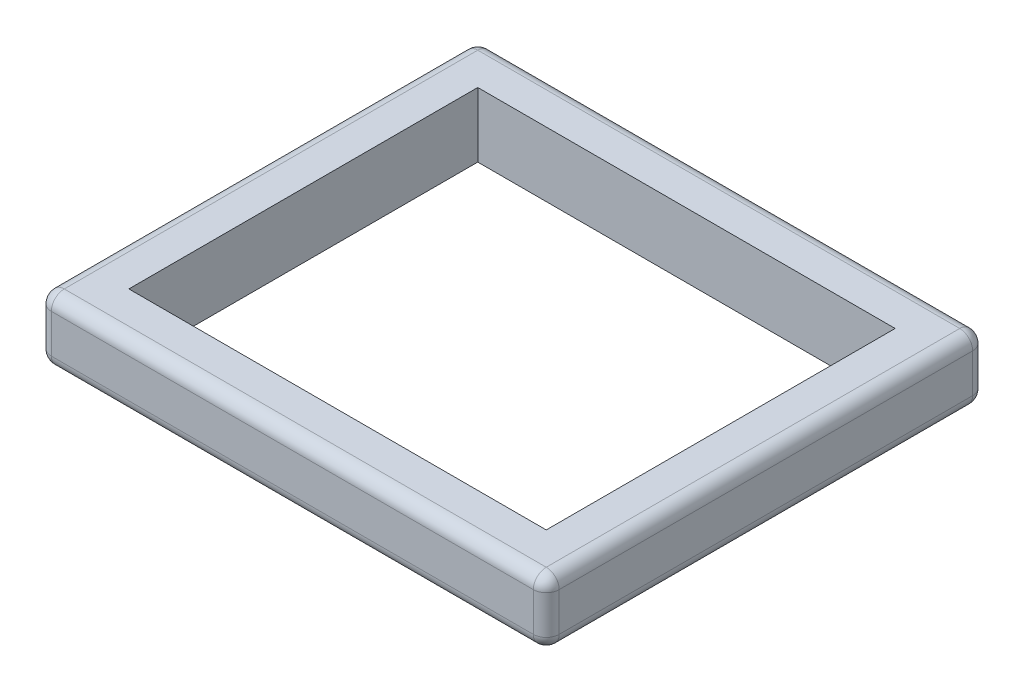
ISO-10303-21;
HEADER;
FILE_DESCRIPTION(('STEP AP214'),'2;1');
FILE_NAME('part.step','',(''),(''),'','','');
FILE_SCHEMA(('AUTOMOTIVE_DESIGN { 1 0 10303 214 1 1 1 1 }'));
ENDSEC;
DATA;
#1=APPLICATION_CONTEXT('core data for automotive mechanical design processes');
#2=APPLICATION_PROTOCOL_DEFINITION('international standard','automotive_design',2000,#1);
#3=PRODUCT_CONTEXT('',#1,'mechanical');
#4=PRODUCT('Part','Part','',(#3));
#5=PRODUCT_RELATED_PRODUCT_CATEGORY('part','',(#4));
#6=PRODUCT_DEFINITION_FORMATION('','',#4);
#7=PRODUCT_DEFINITION_CONTEXT('part definition',#1,'design');
#8=PRODUCT_DEFINITION('design','',#6,#7);
#9=PRODUCT_DEFINITION_SHAPE('','',#8);
#10=(LENGTH_UNIT() NAMED_UNIT(*) SI_UNIT(.MILLI.,.METRE.));
#11=(NAMED_UNIT(*) PLANE_ANGLE_UNIT() SI_UNIT($,.RADIAN.));
#12=(NAMED_UNIT(*) SI_UNIT($,.STERADIAN.) SOLID_ANGLE_UNIT());
#13=UNCERTAINTY_MEASURE_WITH_UNIT(LENGTH_MEASURE(1.E-05),#10,'distance_accuracy_value','');
#14=(GEOMETRIC_REPRESENTATION_CONTEXT(3) GLOBAL_UNCERTAINTY_ASSIGNED_CONTEXT((#13)) GLOBAL_UNIT_ASSIGNED_CONTEXT((#10,
#11,#12)) REPRESENTATION_CONTEXT('',''));
#15=CARTESIAN_POINT('',(0.,0.,0.));
#16=DIRECTION('',(0.,0.,1.));
#17=DIRECTION('',(1.,0.,0.));
#18=AXIS2_PLACEMENT_3D('',#15,#16,#17);
#19=CARTESIAN_POINT('',(725.233239936945,127.,413.743359462589));
#20=DIRECTION('',(0.,0.,1.));
#21=DIRECTION('',(1.,0.,0.));
#22=AXIS2_PLACEMENT_3D('',#19,#20,#21);
#23=PLANE('',#22);
#24=DIRECTION('',(0.,-1.,0.));
#25=VECTOR('',#24,1.);
#26=CARTESIAN_POINT('',(699.833239936945,127.,413.743359462589));
#27=LINE('',#26,#25);
#28=CARTESIAN_POINT('',(699.833239936945,25.4,413.743359462589));
#29=VERTEX_POINT('',#28);
#30=CARTESIAN_POINT('',(699.833239936945,101.6,413.743359462589));
#31=VERTEX_POINT('',#30);
#32=EDGE_CURVE('E206',#29,#31,#27,.F.);
#33=ORIENTED_EDGE('',*,*,#32,.T.);
#34=DIRECTION('',(-1.,0.,0.));
#35=VECTOR('',#34,1.);
#36=CARTESIAN_POINT('',(-272.986760063055,101.6,413.743359462589));
#37=LINE('',#36,#35);
#38=CARTESIAN_POINT('',(-247.586760063055,101.6,413.743359462589));
#39=VERTEX_POINT('',#38);
#40=EDGE_CURVE('E209',#31,#39,#37,.T.);
#41=ORIENTED_EDGE('',*,*,#40,.T.);
#42=DIRECTION('',(0.,-1.,0.));
#43=VECTOR('',#42,1.);
#44=CARTESIAN_POINT('',(-247.586760063055,127.,413.743359462589));
#45=LINE('',#44,#43);
#46=CARTESIAN_POINT('',(-247.586760063055,25.4,413.743359462589));
#47=VERTEX_POINT('',#46);
#48=EDGE_CURVE('E204',#39,#47,#45,.T.);
#49=ORIENTED_EDGE('',*,*,#48,.T.);
#50=DIRECTION('',(-1.,0.,0.));
#51=VECTOR('',#50,1.);
#52=CARTESIAN_POINT('',(725.233239936945,25.4,413.743359462589));
#53=LINE('',#52,#51);
#54=EDGE_CURVE('E202',#47,#29,#53,.F.);
#55=ORIENTED_EDGE('',*,*,#54,.T.);
#56=EDGE_LOOP('',(#33,#41,#49,#55));
#57=FACE_BOUND('',#56,.T.);
#58=ADVANCED_FACE('F38',(#57),#23,.T.);
#59=CARTESIAN_POINT('',(725.233239936945,127.,413.743359462589));
#60=DIRECTION('',(-1.,0.,0.));
#61=DIRECTION('',(0.,0.,1.));
#62=AXIS2_PLACEMENT_3D('',#59,#60,#61);
#63=PLANE('',#62);
#64=DIRECTION('',(0.,0.,-1.));
#65=VECTOR('',#64,1.);
#66=CARTESIAN_POINT('',(725.233239936945,101.6,413.743359462589));
#67=LINE('',#66,#65);
#68=CARTESIAN_POINT('',(725.233239936945,101.6,-424.456640537411));
#69=VERTEX_POINT('',#68);
#70=CARTESIAN_POINT('',(725.233239936945,101.6,388.343359462589));
#71=VERTEX_POINT('',#70);
#72=EDGE_CURVE('E197',#69,#71,#67,.F.);
#73=ORIENTED_EDGE('',*,*,#72,.T.);
#74=DIRECTION('',(0.,-1.,0.));
#75=VECTOR('',#74,1.);
#76=CARTESIAN_POINT('',(725.233239936945,0.,388.343359462589));
#77=LINE('',#76,#75);
#78=CARTESIAN_POINT('',(725.233239936945,25.4,388.343359462589));
#79=VERTEX_POINT('',#78);
#80=EDGE_CURVE('E199',#71,#79,#77,.T.);
#81=ORIENTED_EDGE('',*,*,#80,.T.);
#82=DIRECTION('',(0.,0.,-1.));
#83=VECTOR('',#82,1.);
#84=CARTESIAN_POINT('',(725.233239936945,25.4,-449.856640537411));
#85=LINE('',#84,#83);
#86=CARTESIAN_POINT('',(725.233239936945,25.4,-424.456640537411));
#87=VERTEX_POINT('',#86);
#88=EDGE_CURVE('E195',#79,#87,#85,.T.);
#89=ORIENTED_EDGE('',*,*,#88,.T.);
#90=DIRECTION('',(0.,-1.,0.));
#91=VECTOR('',#90,1.);
#92=CARTESIAN_POINT('',(725.233239936945,127.,-424.456640537411));
#93=LINE('',#92,#91);
#94=EDGE_CURVE('E190',#87,#69,#93,.F.);
#95=ORIENTED_EDGE('',*,*,#94,.T.);
#96=EDGE_LOOP('',(#73,#81,#89,#95));
#97=FACE_BOUND('',#96,.T.);
#98=ADVANCED_FACE('F340',(#97),#63,.F.);
#99=CARTESIAN_POINT('',(725.233239936945,127.,-449.856640537411));
#100=DIRECTION('',(0.,0.,1.));
#101=DIRECTION('',(1.,0.,0.));
#102=AXIS2_PLACEMENT_3D('',#99,#100,#101);
#103=PLANE('',#102);
#104=DIRECTION('',(0.,-1.,0.));
#105=VECTOR('',#104,1.);
#106=CARTESIAN_POINT('',(-247.586760063055,127.,-449.856640537411));
#107=LINE('',#106,#105);
#108=CARTESIAN_POINT('',(-247.586760063055,25.4,-449.856640537411));
#109=VERTEX_POINT('',#108);
#110=CARTESIAN_POINT('',(-247.586760063055,101.6,-449.856640537411));
#111=VERTEX_POINT('',#110);
#112=EDGE_CURVE('E47',#109,#111,#107,.F.);
#113=ORIENTED_EDGE('',*,*,#112,.T.);
#114=DIRECTION('',(-1.,0.,0.));
#115=VECTOR('',#114,1.);
#116=CARTESIAN_POINT('',(725.233239936945,101.6,-449.856640537411));
#117=LINE('',#116,#115);
#118=CARTESIAN_POINT('',(699.833239936945,101.6,-449.856640537411));
#119=VERTEX_POINT('',#118);
#120=EDGE_CURVE('E11',#111,#119,#117,.F.);
#121=ORIENTED_EDGE('',*,*,#120,.T.);
#122=DIRECTION('',(0.,-1.,0.));
#123=VECTOR('',#122,1.);
#124=CARTESIAN_POINT('',(699.833239936945,127.,-449.856640537411));
#125=LINE('',#124,#123);
#126=CARTESIAN_POINT('',(699.833239936945,25.4,-449.856640537411));
#127=VERTEX_POINT('',#126);
#128=EDGE_CURVE('E240',#119,#127,#125,.T.);
#129=ORIENTED_EDGE('',*,*,#128,.T.);
#130=DIRECTION('',(-1.,0.,0.));
#131=VECTOR('',#130,1.);
#132=CARTESIAN_POINT('',(-272.986760063055,25.4,-449.856640537411));
#133=LINE('',#132,#131);
#134=EDGE_CURVE('E238',#127,#109,#133,.T.);
#135=ORIENTED_EDGE('',*,*,#134,.T.);
#136=EDGE_LOOP('',(#113,#121,#129,#135));
#137=FACE_BOUND('',#136,.T.);
#138=ADVANCED_FACE('F346',(#137),#103,.F.);
#139=CARTESIAN_POINT('',(-272.986760063055,127.,413.743359462589));
#140=DIRECTION('',(-1.,0.,0.));
#141=DIRECTION('',(0.,0.,1.));
#142=AXIS2_PLACEMENT_3D('',#139,#140,#141);
#143=PLANE('',#142);
#144=DIRECTION('',(0.,0.,-1.));
#145=VECTOR('',#144,1.);
#146=CARTESIAN_POINT('',(-272.986760063055,25.4,413.743359462589));
#147=LINE('',#146,#145);
#148=CARTESIAN_POINT('',(-272.986760063055,25.4,-424.456640537411));
#149=VERTEX_POINT('',#148);
#150=CARTESIAN_POINT('',(-272.986760063055,25.4,388.343359462589));
#151=VERTEX_POINT('',#150);
#152=EDGE_CURVE('E215',#149,#151,#147,.F.);
#153=ORIENTED_EDGE('',*,*,#152,.T.);
#154=DIRECTION('',(0.,-1.,0.));
#155=VECTOR('',#154,1.);
#156=CARTESIAN_POINT('',(-272.986760063055,127.,388.343359462589));
#157=LINE('',#156,#155);
#158=CARTESIAN_POINT('',(-272.986760063055,101.6,388.343359462589));
#159=VERTEX_POINT('',#158);
#160=EDGE_CURVE('E217',#151,#159,#157,.F.);
#161=ORIENTED_EDGE('',*,*,#160,.T.);
#162=DIRECTION('',(0.,0.,-1.));
#163=VECTOR('',#162,1.);
#164=CARTESIAN_POINT('',(-272.986760063055,101.6,-449.856640537411));
#165=LINE('',#164,#163);
#166=CARTESIAN_POINT('',(-272.986760063055,101.6,-424.456640537411));
#167=VERTEX_POINT('',#166);
#168=EDGE_CURVE('E213',#159,#167,#165,.T.);
#169=ORIENTED_EDGE('',*,*,#168,.T.);
#170=DIRECTION('',(0.,-1.,0.));
#171=VECTOR('',#170,1.);
#172=CARTESIAN_POINT('',(-272.986760063055,0.,-424.456640537411));
#173=LINE('',#172,#171);
#174=EDGE_CURVE('E211',#167,#149,#173,.T.);
#175=ORIENTED_EDGE('',*,*,#174,.T.);
#176=EDGE_LOOP('',(#153,#161,#169,#175));
#177=FACE_BOUND('',#176,.T.);
#178=ADVANCED_FACE('F351',(#177),#143,.T.);
#179=CARTESIAN_POINT('',(0.,127.,0.));
#180=DIRECTION('',(0.,-1.,0.));
#181=DIRECTION('',(0.,0.,-1.));
#182=AXIS2_PLACEMENT_3D('',#179,#180,#181);
#183=PLANE('',#182);
#184=DIRECTION('',(-1.,0.,0.));
#185=VECTOR('',#184,1.);
#186=CARTESIAN_POINT('',(0.,127.,-424.456640537411));
#187=LINE('',#186,#185);
#188=CARTESIAN_POINT('',(699.833239936945,127.,-424.456640537411));
#189=VERTEX_POINT('',#188);
#190=CARTESIAN_POINT('',(-247.586760063055,127.,-424.456640537411));
#191=VERTEX_POINT('',#190);
#192=EDGE_CURVE('E229',#189,#191,#187,.T.);
#193=ORIENTED_EDGE('',*,*,#192,.T.);
#194=DIRECTION('',(0.,0.,-1.));
#195=VECTOR('',#194,1.);
#196=CARTESIAN_POINT('',(-247.586760063055,127.,413.743359462589));
#197=LINE('',#196,#195);
#198=CARTESIAN_POINT('',(-247.586760063055,127.,388.343359462589));
#199=VERTEX_POINT('',#198);
#200=EDGE_CURVE('E235',#191,#199,#197,.F.);
#201=ORIENTED_EDGE('',*,*,#200,.T.);
#202=DIRECTION('',(-1.,0.,0.));
#203=VECTOR('',#202,1.);
#204=CARTESIAN_POINT('',(725.233239936945,127.,388.343359462589));
#205=LINE('',#204,#203);
#206=CARTESIAN_POINT('',(699.833239936945,127.,388.343359462589));
#207=VERTEX_POINT('',#206);
#208=EDGE_CURVE('E233',#199,#207,#205,.F.);
#209=ORIENTED_EDGE('',*,*,#208,.T.);
#210=DIRECTION('',(0.,0.,-1.));
#211=VECTOR('',#210,1.);
#212=CARTESIAN_POINT('',(699.833239936945,127.,0.));
#213=LINE('',#212,#211);
#214=EDGE_CURVE('E231',#207,#189,#213,.T.);
#215=ORIENTED_EDGE('',*,*,#214,.T.);
#216=EDGE_LOOP('',(#193,#201,#209,#215));
#217=FACE_BOUND('',#216,.T.);
#218=DIRECTION('',(-1.,0.,0.));
#219=VECTOR('',#218,1.);
#220=CARTESIAN_POINT('',(636.333239936945,127.,324.843359462589));
#221=LINE('',#220,#219);
#222=CARTESIAN_POINT('',(636.333239936945,127.,324.843359462589));
#223=VERTEX_POINT('',#222);
#224=CARTESIAN_POINT('',(-184.086760063055,127.,324.843359462589));
#225=VERTEX_POINT('',#224);
#226=EDGE_CURVE('E163',#223,#225,#221,.T.);
#227=ORIENTED_EDGE('',*,*,#226,.T.);
#228=DIRECTION('',(0.,0.,-1.));
#229=VECTOR('',#228,1.);
#230=CARTESIAN_POINT('',(-184.086760063055,127.,-360.956640537411));
#231=LINE('',#230,#229);
#232=CARTESIAN_POINT('',(-184.086760063055,127.,-360.956640537411));
#233=VERTEX_POINT('',#232);
#234=EDGE_CURVE('E155',#225,#233,#231,.T.);
#235=ORIENTED_EDGE('',*,*,#234,.T.);
#236=DIRECTION('',(1.,0.,0.));
#237=VECTOR('',#236,1.);
#238=CARTESIAN_POINT('',(636.333239936945,127.,-360.956640537411));
#239=LINE('',#238,#237);
#240=CARTESIAN_POINT('',(636.333239936945,127.,-360.956640537411));
#241=VERTEX_POINT('',#240);
#242=EDGE_CURVE('E167',#233,#241,#239,.T.);
#243=ORIENTED_EDGE('',*,*,#242,.T.);
#244=DIRECTION('',(0.,0.,1.));
#245=VECTOR('',#244,1.);
#246=CARTESIAN_POINT('',(636.333239936945,127.,-360.956640537411));
#247=LINE('',#246,#245);
#248=EDGE_CURVE('E171',#241,#223,#247,.T.);
#249=ORIENTED_EDGE('',*,*,#248,.T.);
#250=EDGE_LOOP('',(#227,#235,#243,#249));
#251=FACE_BOUND('',#250,.T.);
#252=ADVANCED_FACE('F173',(#217,#251),#183,.F.);
#253=CARTESIAN_POINT('',(0.,0.,0.));
#254=DIRECTION('',(0.,-1.,0.));
#255=DIRECTION('',(0.,0.,-1.));
#256=AXIS2_PLACEMENT_3D('',#253,#254,#255);
#257=PLANE('',#256);
#258=DIRECTION('',(-1.,0.,0.));
#259=VECTOR('',#258,1.);
#260=CARTESIAN_POINT('',(0.,0.,388.343359462589));
#261=LINE('',#260,#259);
#262=CARTESIAN_POINT('',(699.833239936945,0.,388.343359462589));
#263=VERTEX_POINT('',#262);
#264=CARTESIAN_POINT('',(-247.586760063055,0.,388.343359462589));
#265=VERTEX_POINT('',#264);
#266=EDGE_CURVE('E224',#263,#265,#261,.T.);
#267=ORIENTED_EDGE('',*,*,#266,.T.);
#268=DIRECTION('',(0.,0.,-1.));
#269=VECTOR('',#268,1.);
#270=CARTESIAN_POINT('',(-247.586760063055,0.,0.));
#271=LINE('',#270,#269);
#272=CARTESIAN_POINT('',(-247.586760063055,0.,-424.456640537411));
#273=VERTEX_POINT('',#272);
#274=EDGE_CURVE('E226',#265,#273,#271,.T.);
#275=ORIENTED_EDGE('',*,*,#274,.T.);
#276=DIRECTION('',(-1.,0.,0.));
#277=VECTOR('',#276,1.);
#278=CARTESIAN_POINT('',(725.233239936945,0.,-424.456640537411));
#279=LINE('',#278,#277);
#280=CARTESIAN_POINT('',(699.833239936945,0.,-424.456640537411));
#281=VERTEX_POINT('',#280);
#282=EDGE_CURVE('E220',#273,#281,#279,.F.);
#283=ORIENTED_EDGE('',*,*,#282,.T.);
#284=DIRECTION('',(0.,0.,-1.));
#285=VECTOR('',#284,1.);
#286=CARTESIAN_POINT('',(699.833239936945,0.,413.743359462589));
#287=LINE('',#286,#285);
#288=EDGE_CURVE('E222',#281,#263,#287,.F.);
#289=ORIENTED_EDGE('',*,*,#288,.T.);
#290=EDGE_LOOP('',(#267,#275,#283,#289));
#291=FACE_BOUND('',#290,.T.);
#292=DIRECTION('',(0.,0.,-1.));
#293=VECTOR('',#292,1.);
#294=CARTESIAN_POINT('',(-184.086760063055,0.,-360.956640537411));
#295=LINE('',#294,#293);
#296=CARTESIAN_POINT('',(-184.086760063055,0.,324.843359462589));
#297=VERTEX_POINT('',#296);
#298=CARTESIAN_POINT('',(-184.086760063055,0.,-360.956640537411));
#299=VERTEX_POINT('',#298);
#300=EDGE_CURVE('E158',#297,#299,#295,.T.);
#301=ORIENTED_EDGE('',*,*,#300,.F.);
#302=DIRECTION('',(-1.,0.,0.));
#303=VECTOR('',#302,1.);
#304=CARTESIAN_POINT('',(636.333239936945,0.,324.843359462589));
#305=LINE('',#304,#303);
#306=CARTESIAN_POINT('',(636.333239936945,0.,324.843359462589));
#307=VERTEX_POINT('',#306);
#308=EDGE_CURVE('E175',#307,#297,#305,.T.);
#309=ORIENTED_EDGE('',*,*,#308,.F.);
#310=DIRECTION('',(0.,0.,1.));
#311=VECTOR('',#310,1.);
#312=CARTESIAN_POINT('',(636.333239936945,0.,-360.956640537411));
#313=LINE('',#312,#311);
#314=CARTESIAN_POINT('',(636.333239936945,0.,-360.956640537411));
#315=VERTEX_POINT('',#314);
#316=EDGE_CURVE('E178',#315,#307,#313,.T.);
#317=ORIENTED_EDGE('',*,*,#316,.F.);
#318=DIRECTION('',(1.,0.,0.));
#319=VECTOR('',#318,1.);
#320=CARTESIAN_POINT('',(636.333239936945,0.,-360.956640537411));
#321=LINE('',#320,#319);
#322=EDGE_CURVE('E184',#299,#315,#321,.T.);
#323=ORIENTED_EDGE('',*,*,#322,.F.);
#324=EDGE_LOOP('',(#301,#309,#317,#323));
#325=FACE_BOUND('',#324,.T.);
#326=ADVANCED_FACE('F416',(#291,#325),#257,.T.);
#327=CARTESIAN_POINT('',(-184.086760063055,127.,-360.956640537411));
#328=DIRECTION('',(-1.,0.,0.));
#329=DIRECTION('',(0.,0.,1.));
#330=AXIS2_PLACEMENT_3D('',#327,#328,#329);
#331=PLANE('',#330);
#332=ORIENTED_EDGE('',*,*,#300,.T.);
#333=DIRECTION('',(0.,-1.,0.));
#334=VECTOR('',#333,1.);
#335=CARTESIAN_POINT('',(-184.086760063055,127.,-360.956640537411));
#336=LINE('',#335,#334);
#337=EDGE_CURVE('E151',#233,#299,#336,.T.);
#338=ORIENTED_EDGE('',*,*,#337,.F.);
#339=ORIENTED_EDGE('',*,*,#234,.F.);
#340=DIRECTION('',(0.,-1.,0.));
#341=VECTOR('',#340,1.);
#342=CARTESIAN_POINT('',(-184.086760063055,127.,324.843359462589));
#343=LINE('',#342,#341);
#344=EDGE_CURVE('E188',#225,#297,#343,.T.);
#345=ORIENTED_EDGE('',*,*,#344,.T.);
#346=EDGE_LOOP('',(#332,#338,#339,#345));
#347=FACE_BOUND('',#346,.T.);
#348=ADVANCED_FACE('F153',(#347),#331,.F.);
#349=CARTESIAN_POINT('',(636.333239936945,127.,324.843359462589));
#350=DIRECTION('',(0.,0.,1.));
#351=DIRECTION('',(1.,0.,0.));
#352=AXIS2_PLACEMENT_3D('',#349,#350,#351);
#353=PLANE('',#352);
#354=ORIENTED_EDGE('',*,*,#308,.T.);
#355=ORIENTED_EDGE('',*,*,#344,.F.);
#356=ORIENTED_EDGE('',*,*,#226,.F.);
#357=DIRECTION('',(0.,-1.,0.));
#358=VECTOR('',#357,1.);
#359=CARTESIAN_POINT('',(636.333239936945,127.,324.843359462589));
#360=LINE('',#359,#358);
#361=EDGE_CURVE('E191',#223,#307,#360,.T.);
#362=ORIENTED_EDGE('',*,*,#361,.T.);
#363=EDGE_LOOP('',(#354,#355,#356,#362));
#364=FACE_BOUND('',#363,.T.);
#365=ADVANCED_FACE('F454',(#364),#353,.F.);
#366=CARTESIAN_POINT('',(636.333239936945,127.,-360.956640537411));
#367=DIRECTION('',(1.,0.,0.));
#368=DIRECTION('',(0.,0.,-1.));
#369=AXIS2_PLACEMENT_3D('',#366,#367,#368);
#370=PLANE('',#369);
#371=ORIENTED_EDGE('',*,*,#316,.T.);
#372=ORIENTED_EDGE('',*,*,#361,.F.);
#373=ORIENTED_EDGE('',*,*,#248,.F.);
#374=DIRECTION('',(0.,-1.,0.));
#375=VECTOR('',#374,1.);
#376=CARTESIAN_POINT('',(636.333239936945,127.,-360.956640537411));
#377=LINE('',#376,#375);
#378=EDGE_CURVE('E162',#241,#315,#377,.T.);
#379=ORIENTED_EDGE('',*,*,#378,.T.);
#380=EDGE_LOOP('',(#371,#372,#373,#379));
#381=FACE_BOUND('',#380,.T.);
#382=ADVANCED_FACE('F457',(#381),#370,.F.);
#383=CARTESIAN_POINT('',(636.333239936945,127.,-360.956640537411));
#384=DIRECTION('',(0.,0.,-1.));
#385=DIRECTION('',(-1.,0.,0.));
#386=AXIS2_PLACEMENT_3D('',#383,#384,#385);
#387=PLANE('',#386);
#388=ORIENTED_EDGE('',*,*,#322,.T.);
#389=ORIENTED_EDGE('',*,*,#378,.F.);
#390=ORIENTED_EDGE('',*,*,#242,.F.);
#391=ORIENTED_EDGE('',*,*,#337,.T.);
#392=EDGE_LOOP('',(#388,#389,#390,#391));
#393=FACE_BOUND('',#392,.T.);
#394=ADVANCED_FACE('F168',(#393),#387,.F.);
#395=CARTESIAN_POINT('',(-247.586760063055,127.,-424.456640537411));
#396=DIRECTION('',(0.,1.,0.));
#397=DIRECTION('',(0.,0.,1.));
#398=AXIS2_PLACEMENT_3D('',#395,#396,#397);
#399=CYLINDRICAL_SURFACE('',#398,25.4);
#400=CARTESIAN_POINT('',(-247.586760063055,101.6,-424.456640537411));
#401=DIRECTION('',(0.,1.,0.));
#402=DIRECTION('',(0.,0.,1.));
#403=AXIS2_PLACEMENT_3D('',#400,#401,#402);
#404=CIRCLE('',#403,25.4);
#405=EDGE_CURVE('E42',#111,#167,#404,.T.);
#406=ORIENTED_EDGE('',*,*,#405,.F.);
#407=ORIENTED_EDGE('',*,*,#112,.F.);
#408=CARTESIAN_POINT('',(-247.586760063055,25.4,-424.456640537411));
#409=DIRECTION('',(0.,-1.,0.));
#410=DIRECTION('',(0.,0.,-1.));
#411=AXIS2_PLACEMENT_3D('',#408,#409,#410);
#412=CIRCLE('',#411,25.4);
#413=EDGE_CURVE('E304',#149,#109,#412,.T.);
#414=ORIENTED_EDGE('',*,*,#413,.F.);
#415=ORIENTED_EDGE('',*,*,#174,.F.);
#416=EDGE_LOOP('',(#406,#407,#414,#415));
#417=FACE_BOUND('',#416,.T.);
#418=ADVANCED_FACE('F40',(#417),#399,.T.);
#419=CARTESIAN_POINT('',(-247.586760063055,101.6,-424.456640537411));
#420=DIRECTION('',(0.,0.,1.));
#421=DIRECTION('',(1.,0.,0.));
#422=AXIS2_PLACEMENT_3D('',#419,#420,#421);
#423=SPHERICAL_SURFACE('',#422,25.4);
#424=CARTESIAN_POINT('',(-247.586760063055,101.6,-424.456640537411));
#425=DIRECTION('',(-1.,0.,0.));
#426=DIRECTION('',(0.,0.,1.));
#427=AXIS2_PLACEMENT_3D('',#424,#425,#426);
#428=CIRCLE('',#427,25.4);
#429=EDGE_CURVE('E300',#111,#191,#428,.F.);
#430=ORIENTED_EDGE('',*,*,#429,.F.);
#431=ORIENTED_EDGE('',*,*,#405,.T.);
#432=CARTESIAN_POINT('',(-247.586760063055,101.6,-424.456640537411));
#433=DIRECTION('',(0.,0.,-1.));
#434=DIRECTION('',(-1.,0.,0.));
#435=AXIS2_PLACEMENT_3D('',#432,#433,#434);
#436=CIRCLE('',#435,25.4);
#437=EDGE_CURVE('E302',#191,#167,#436,.F.);
#438=ORIENTED_EDGE('',*,*,#437,.F.);
#439=EDGE_LOOP('',(#430,#431,#438));
#440=FACE_BOUND('',#439,.T.);
#441=ADVANCED_FACE('F314',(#440),#423,.T.);
#442=CARTESIAN_POINT('',(-247.586760063055,25.4,-424.456640537411));
#443=DIRECTION('',(0.,0.,1.));
#444=DIRECTION('',(1.,0.,0.));
#445=AXIS2_PLACEMENT_3D('',#442,#443,#444);
#446=SPHERICAL_SURFACE('',#445,25.4);
#447=CARTESIAN_POINT('',(-247.586760063055,25.4,-424.456640537411));
#448=DIRECTION('',(0.,0.,-1.));
#449=DIRECTION('',(-1.,0.,0.));
#450=AXIS2_PLACEMENT_3D('',#447,#448,#449);
#451=CIRCLE('',#450,25.4);
#452=EDGE_CURVE('E294',#149,#273,#451,.F.);
#453=ORIENTED_EDGE('',*,*,#452,.F.);
#454=ORIENTED_EDGE('',*,*,#413,.T.);
#455=CARTESIAN_POINT('',(-247.586760063055,25.4,-424.456640537411));
#456=DIRECTION('',(-1.,0.,0.));
#457=DIRECTION('',(0.,0.,1.));
#458=AXIS2_PLACEMENT_3D('',#455,#456,#457);
#459=CIRCLE('',#458,25.4);
#460=EDGE_CURVE('E297',#273,#109,#459,.F.);
#461=ORIENTED_EDGE('',*,*,#460,.F.);
#462=EDGE_LOOP('',(#453,#454,#461));
#463=FACE_BOUND('',#462,.T.);
#464=ADVANCED_FACE('F337',(#463),#446,.T.);
#465=CARTESIAN_POINT('',(-247.586760063055,101.6,413.743359462589));
#466=DIRECTION('',(0.,0.,1.));
#467=DIRECTION('',(1.,0.,0.));
#468=AXIS2_PLACEMENT_3D('',#465,#466,#467);
#469=CYLINDRICAL_SURFACE('',#468,25.4);
#470=ORIENTED_EDGE('',*,*,#437,.T.);
#471=ORIENTED_EDGE('',*,*,#168,.F.);
#472=CARTESIAN_POINT('',(-247.586760063055,101.6,388.343359462589));
#473=DIRECTION('',(0.,0.,1.));
#474=DIRECTION('',(1.,0.,0.));
#475=AXIS2_PLACEMENT_3D('',#472,#473,#474);
#476=CIRCLE('',#475,25.4);
#477=EDGE_CURVE('E289',#199,#159,#476,.T.);
#478=ORIENTED_EDGE('',*,*,#477,.F.);
#479=ORIENTED_EDGE('',*,*,#200,.F.);
#480=EDGE_LOOP('',(#470,#471,#478,#479));
#481=FACE_BOUND('',#480,.T.);
#482=ADVANCED_FACE('F321',(#481),#469,.T.);
#483=CARTESIAN_POINT('',(0.,101.6,-424.456640537411));
#484=DIRECTION('',(-1.,0.,0.));
#485=DIRECTION('',(0.,0.,1.));
#486=AXIS2_PLACEMENT_3D('',#483,#484,#485);
#487=CYLINDRICAL_SURFACE('',#486,25.4);
#488=ORIENTED_EDGE('',*,*,#429,.T.);
#489=ORIENTED_EDGE('',*,*,#192,.F.);
#490=CARTESIAN_POINT('',(699.833239936945,101.6,-424.456640537411));
#491=DIRECTION('',(1.,0.,0.));
#492=DIRECTION('',(0.,0.,-1.));
#493=AXIS2_PLACEMENT_3D('',#490,#491,#492);
#494=CIRCLE('',#493,25.4);
#495=EDGE_CURVE('E286',#119,#189,#494,.T.);
#496=ORIENTED_EDGE('',*,*,#495,.F.);
#497=ORIENTED_EDGE('',*,*,#120,.F.);
#498=EDGE_LOOP('',(#488,#489,#496,#497));
#499=FACE_BOUND('',#498,.T.);
#500=ADVANCED_FACE('F326',(#499),#487,.T.);
#501=CARTESIAN_POINT('',(699.833239936945,127.,-424.456640537411));
#502=DIRECTION('',(0.,-1.,0.));
#503=DIRECTION('',(0.,0.,-1.));
#504=AXIS2_PLACEMENT_3D('',#501,#502,#503);
#505=CYLINDRICAL_SURFACE('',#504,25.4);
#506=CARTESIAN_POINT('',(699.833239936945,25.4,-424.456640537411));
#507=DIRECTION('',(0.,-1.,0.));
#508=DIRECTION('',(0.,0.,-1.));
#509=AXIS2_PLACEMENT_3D('',#506,#507,#508);
#510=CIRCLE('',#509,25.4);
#511=EDGE_CURVE('E280',#127,#87,#510,.T.);
#512=ORIENTED_EDGE('',*,*,#511,.F.);
#513=ORIENTED_EDGE('',*,*,#128,.F.);
#514=CARTESIAN_POINT('',(699.833239936945,101.6,-424.456640537411));
#515=DIRECTION('',(0.,1.,0.));
#516=DIRECTION('',(0.,0.,1.));
#517=AXIS2_PLACEMENT_3D('',#514,#515,#516);
#518=CIRCLE('',#517,25.4);
#519=EDGE_CURVE('E283',#69,#119,#518,.T.);
#520=ORIENTED_EDGE('',*,*,#519,.F.);
#521=ORIENTED_EDGE('',*,*,#94,.F.);
#522=EDGE_LOOP('',(#512,#513,#520,#521));
#523=FACE_BOUND('',#522,.T.);
#524=ADVANCED_FACE('F328',(#523),#505,.T.);
#525=CARTESIAN_POINT('',(725.233239936945,25.4,-424.456640537411));
#526=DIRECTION('',(1.,0.,0.));
#527=DIRECTION('',(0.,0.,-1.));
#528=AXIS2_PLACEMENT_3D('',#525,#526,#527);
#529=CYLINDRICAL_SURFACE('',#528,25.4);
#530=ORIENTED_EDGE('',*,*,#460,.T.);
#531=ORIENTED_EDGE('',*,*,#134,.F.);
#532=CARTESIAN_POINT('',(699.833239936945,25.4,-424.456640537411));
#533=DIRECTION('',(1.,0.,0.));
#534=DIRECTION('',(0.,0.,-1.));
#535=AXIS2_PLACEMENT_3D('',#532,#533,#534);
#536=CIRCLE('',#535,25.4);
#537=EDGE_CURVE('E277',#281,#127,#536,.T.);
#538=ORIENTED_EDGE('',*,*,#537,.F.);
#539=ORIENTED_EDGE('',*,*,#282,.F.);
#540=EDGE_LOOP('',(#530,#531,#538,#539));
#541=FACE_BOUND('',#540,.T.);
#542=ADVANCED_FACE('F334',(#541),#529,.T.);
#543=CARTESIAN_POINT('',(-247.586760063055,25.4,0.));
#544=DIRECTION('',(0.,0.,-1.));
#545=DIRECTION('',(-1.,0.,0.));
#546=AXIS2_PLACEMENT_3D('',#543,#544,#545);
#547=CYLINDRICAL_SURFACE('',#546,25.4);
#548=ORIENTED_EDGE('',*,*,#452,.T.);
#549=ORIENTED_EDGE('',*,*,#274,.F.);
#550=CARTESIAN_POINT('',(-247.586760063055,25.4,388.343359462589));
#551=DIRECTION('',(0.,0.,1.));
#552=DIRECTION('',(1.,0.,0.));
#553=AXIS2_PLACEMENT_3D('',#550,#551,#552);
#554=CIRCLE('',#553,25.4);
#555=EDGE_CURVE('E274',#151,#265,#554,.T.);
#556=ORIENTED_EDGE('',*,*,#555,.F.);
#557=ORIENTED_EDGE('',*,*,#152,.F.);
#558=EDGE_LOOP('',(#548,#549,#556,#557));
#559=FACE_BOUND('',#558,.T.);
#560=ADVANCED_FACE('F400',(#559),#547,.T.);
#561=CARTESIAN_POINT('',(-247.586760063055,127.,388.343359462589));
#562=DIRECTION('',(0.,-1.,0.));
#563=DIRECTION('',(0.,0.,-1.));
#564=AXIS2_PLACEMENT_3D('',#561,#562,#563);
#565=CYLINDRICAL_SURFACE('',#564,25.4);
#566=CARTESIAN_POINT('',(-247.586760063055,101.6,388.343359462589));
#567=DIRECTION('',(0.,1.,0.));
#568=DIRECTION('',(0.,0.,1.));
#569=AXIS2_PLACEMENT_3D('',#566,#567,#568);
#570=CIRCLE('',#569,25.4);
#571=EDGE_CURVE('E291',#159,#39,#570,.T.);
#572=ORIENTED_EDGE('',*,*,#571,.F.);
#573=ORIENTED_EDGE('',*,*,#160,.F.);
#574=CARTESIAN_POINT('',(-247.586760063055,25.4,388.343359462589));
#575=DIRECTION('',(0.,-1.,0.));
#576=DIRECTION('',(0.,0.,-1.));
#577=AXIS2_PLACEMENT_3D('',#574,#575,#576);
#578=CIRCLE('',#577,25.4);
#579=EDGE_CURVE('E271',#47,#151,#578,.T.);
#580=ORIENTED_EDGE('',*,*,#579,.F.);
#581=ORIENTED_EDGE('',*,*,#48,.F.);
#582=EDGE_LOOP('',(#572,#573,#580,#581));
#583=FACE_BOUND('',#582,.T.);
#584=ADVANCED_FACE('F396',(#583),#565,.T.);
#585=CARTESIAN_POINT('',(-247.586760063055,101.6,388.343359462589));
#586=DIRECTION('',(0.,0.,1.));
#587=DIRECTION('',(1.,0.,0.));
#588=AXIS2_PLACEMENT_3D('',#585,#586,#587);
#589=SPHERICAL_SURFACE('',#588,25.4);
#590=ORIENTED_EDGE('',*,*,#477,.T.);
#591=ORIENTED_EDGE('',*,*,#571,.T.);
#592=CARTESIAN_POINT('',(-247.586760063055,101.6,388.343359462589));
#593=DIRECTION('',(-1.,0.,0.));
#594=DIRECTION('',(0.,-1.,0.));
#595=AXIS2_PLACEMENT_3D('',#592,#593,#594);
#596=CIRCLE('',#595,25.4);
#597=EDGE_CURVE('E268',#199,#39,#596,.F.);
#598=ORIENTED_EDGE('',*,*,#597,.F.);
#599=EDGE_LOOP('',(#590,#591,#598));
#600=FACE_BOUND('',#599,.T.);
#601=ADVANCED_FACE('F392',(#600),#589,.T.);
#602=CARTESIAN_POINT('',(699.833239936945,101.6,-424.456640537411));
#603=DIRECTION('',(0.,0.,1.));
#604=DIRECTION('',(1.,0.,0.));
#605=AXIS2_PLACEMENT_3D('',#602,#603,#604);
#606=SPHERICAL_SURFACE('',#605,25.4);
#607=ORIENTED_EDGE('',*,*,#519,.T.);
#608=ORIENTED_EDGE('',*,*,#495,.T.);
#609=CARTESIAN_POINT('',(699.833239936945,101.6,-424.456640537411));
#610=DIRECTION('',(0.,0.,-1.));
#611=DIRECTION('',(-1.,0.,0.));
#612=AXIS2_PLACEMENT_3D('',#609,#610,#611);
#613=CIRCLE('',#612,25.4);
#614=EDGE_CURVE('E265',#69,#189,#613,.F.);
#615=ORIENTED_EDGE('',*,*,#614,.F.);
#616=EDGE_LOOP('',(#607,#608,#615));
#617=FACE_BOUND('',#616,.T.);
#618=ADVANCED_FACE('F388',(#617),#606,.T.);
#619=CARTESIAN_POINT('',(699.833239936945,25.4,-424.456640537411));
#620=DIRECTION('',(0.,0.,1.));
#621=DIRECTION('',(1.,0.,0.));
#622=AXIS2_PLACEMENT_3D('',#619,#620,#621);
#623=SPHERICAL_SURFACE('',#622,25.4);
#624=ORIENTED_EDGE('',*,*,#537,.T.);
#625=ORIENTED_EDGE('',*,*,#511,.T.);
#626=CARTESIAN_POINT('',(699.833239936945,25.4,-424.456640537411));
#627=DIRECTION('',(0.,0.,-1.));
#628=DIRECTION('',(-1.,0.,0.));
#629=AXIS2_PLACEMENT_3D('',#626,#627,#628);
#630=CIRCLE('',#629,25.4);
#631=EDGE_CURVE('E262',#281,#87,#630,.F.);
#632=ORIENTED_EDGE('',*,*,#631,.F.);
#633=EDGE_LOOP('',(#624,#625,#632));
#634=FACE_BOUND('',#633,.T.);
#635=ADVANCED_FACE('F384',(#634),#623,.T.);
#636=CARTESIAN_POINT('',(-247.586760063055,25.4,388.343359462589));
#637=DIRECTION('',(0.,0.,1.));
#638=DIRECTION('',(1.,0.,0.));
#639=AXIS2_PLACEMENT_3D('',#636,#637,#638);
#640=SPHERICAL_SURFACE('',#639,25.4);
#641=ORIENTED_EDGE('',*,*,#579,.T.);
#642=ORIENTED_EDGE('',*,*,#555,.T.);
#643=CARTESIAN_POINT('',(-247.586760063055,25.4,388.343359462589));
#644=DIRECTION('',(-1.,0.,0.));
#645=DIRECTION('',(0.,0.,1.));
#646=AXIS2_PLACEMENT_3D('',#643,#644,#645);
#647=CIRCLE('',#646,25.4);
#648=EDGE_CURVE('E259',#47,#265,#647,.F.);
#649=ORIENTED_EDGE('',*,*,#648,.F.);
#650=EDGE_LOOP('',(#641,#642,#649));
#651=FACE_BOUND('',#650,.T.);
#652=ADVANCED_FACE('F380',(#651),#640,.T.);
#653=CARTESIAN_POINT('',(725.233239936945,101.6,388.343359462589));
#654=DIRECTION('',(1.,0.,0.));
#655=DIRECTION('',(0.,0.,-1.));
#656=AXIS2_PLACEMENT_3D('',#653,#654,#655);
#657=CYLINDRICAL_SURFACE('',#656,25.4);
#658=ORIENTED_EDGE('',*,*,#597,.T.);
#659=ORIENTED_EDGE('',*,*,#40,.F.);
#660=CARTESIAN_POINT('',(699.833239936945,101.6,388.343359462589));
#661=DIRECTION('',(1.,0.,0.));
#662=DIRECTION('',(0.,0.,-1.));
#663=AXIS2_PLACEMENT_3D('',#660,#661,#662);
#664=CIRCLE('',#663,25.4);
#665=EDGE_CURVE('E256',#207,#31,#664,.T.);
#666=ORIENTED_EDGE('',*,*,#665,.F.);
#667=ORIENTED_EDGE('',*,*,#208,.F.);
#668=EDGE_LOOP('',(#658,#659,#666,#667));
#669=FACE_BOUND('',#668,.T.);
#670=ADVANCED_FACE('F376',(#669),#657,.T.);
#671=CARTESIAN_POINT('',(699.833239936945,101.6,0.));
#672=DIRECTION('',(0.,0.,-1.));
#673=DIRECTION('',(-1.,0.,0.));
#674=AXIS2_PLACEMENT_3D('',#671,#672,#673);
#675=CYLINDRICAL_SURFACE('',#674,25.4);
#676=ORIENTED_EDGE('',*,*,#614,.T.);
#677=ORIENTED_EDGE('',*,*,#214,.F.);
#678=CARTESIAN_POINT('',(699.833239936945,101.6,388.343359462589));
#679=DIRECTION('',(0.,0.,1.));
#680=DIRECTION('',(1.,0.,0.));
#681=AXIS2_PLACEMENT_3D('',#678,#679,#680);
#682=CIRCLE('',#681,25.4);
#683=EDGE_CURVE('E253',#71,#207,#682,.T.);
#684=ORIENTED_EDGE('',*,*,#683,.F.);
#685=ORIENTED_EDGE('',*,*,#72,.F.);
#686=EDGE_LOOP('',(#676,#677,#684,#685));
#687=FACE_BOUND('',#686,.T.);
#688=ADVANCED_FACE('F372',(#687),#675,.T.);
#689=CARTESIAN_POINT('',(699.833239936945,25.4,413.743359462589));
#690=DIRECTION('',(0.,0.,1.));
#691=DIRECTION('',(1.,0.,0.));
#692=AXIS2_PLACEMENT_3D('',#689,#690,#691);
#693=CYLINDRICAL_SURFACE('',#692,25.4);
#694=ORIENTED_EDGE('',*,*,#631,.T.);
#695=ORIENTED_EDGE('',*,*,#88,.F.);
#696=CARTESIAN_POINT('',(699.833239936945,25.4,388.343359462589));
#697=DIRECTION('',(0.,0.,1.));
#698=DIRECTION('',(1.,0.,0.));
#699=AXIS2_PLACEMENT_3D('',#696,#697,#698);
#700=CIRCLE('',#699,25.4);
#701=EDGE_CURVE('E250',#263,#79,#700,.T.);
#702=ORIENTED_EDGE('',*,*,#701,.F.);
#703=ORIENTED_EDGE('',*,*,#288,.F.);
#704=EDGE_LOOP('',(#694,#695,#702,#703));
#705=FACE_BOUND('',#704,.T.);
#706=ADVANCED_FACE('F368',(#705),#693,.T.);
#707=CARTESIAN_POINT('',(0.,25.4,388.343359462589));
#708=DIRECTION('',(-1.,0.,0.));
#709=DIRECTION('',(0.,0.,1.));
#710=AXIS2_PLACEMENT_3D('',#707,#708,#709);
#711=CYLINDRICAL_SURFACE('',#710,25.4);
#712=ORIENTED_EDGE('',*,*,#648,.T.);
#713=ORIENTED_EDGE('',*,*,#266,.F.);
#714=CARTESIAN_POINT('',(699.833239936945,25.4,388.343359462589));
#715=DIRECTION('',(1.,0.,0.));
#716=DIRECTION('',(0.,0.,-1.));
#717=AXIS2_PLACEMENT_3D('',#714,#715,#716);
#718=CIRCLE('',#717,25.4);
#719=EDGE_CURVE('E247',#29,#263,#718,.T.);
#720=ORIENTED_EDGE('',*,*,#719,.F.);
#721=ORIENTED_EDGE('',*,*,#54,.F.);
#722=EDGE_LOOP('',(#712,#713,#720,#721));
#723=FACE_BOUND('',#722,.T.);
#724=ADVANCED_FACE('F364',(#723),#711,.T.);
#725=CARTESIAN_POINT('',(699.833239936945,101.6,388.343359462589));
#726=DIRECTION('',(0.,0.,1.));
#727=DIRECTION('',(1.,0.,0.));
#728=AXIS2_PLACEMENT_3D('',#725,#726,#727);
#729=SPHERICAL_SURFACE('',#728,25.4);
#730=ORIENTED_EDGE('',*,*,#683,.T.);
#731=ORIENTED_EDGE('',*,*,#665,.T.);
#732=CARTESIAN_POINT('',(699.833239936945,101.6,388.343359462589));
#733=DIRECTION('',(0.,1.,0.));
#734=DIRECTION('',(0.,0.,1.));
#735=AXIS2_PLACEMENT_3D('',#732,#733,#734);
#736=CIRCLE('',#735,25.4);
#737=EDGE_CURVE('E245',#71,#31,#736,.F.);
#738=ORIENTED_EDGE('',*,*,#737,.F.);
#739=EDGE_LOOP('',(#730,#731,#738));
#740=FACE_BOUND('',#739,.T.);
#741=ADVANCED_FACE('F360',(#740),#729,.T.);
#742=CARTESIAN_POINT('',(699.833239936945,25.4,388.343359462589));
#743=DIRECTION('',(0.,0.,1.));
#744=DIRECTION('',(1.,0.,0.));
#745=AXIS2_PLACEMENT_3D('',#742,#743,#744);
#746=SPHERICAL_SURFACE('',#745,25.4);
#747=ORIENTED_EDGE('',*,*,#719,.T.);
#748=ORIENTED_EDGE('',*,*,#701,.T.);
#749=CARTESIAN_POINT('',(699.833239936945,25.4,388.343359462589));
#750=DIRECTION('',(0.,-1.,0.));
#751=DIRECTION('',(0.,0.,-1.));
#752=AXIS2_PLACEMENT_3D('',#749,#750,#751);
#753=CIRCLE('',#752,25.4);
#754=EDGE_CURVE('E243',#29,#79,#753,.F.);
#755=ORIENTED_EDGE('',*,*,#754,.F.);
#756=EDGE_LOOP('',(#747,#748,#755));
#757=FACE_BOUND('',#756,.T.);
#758=ADVANCED_FACE('F356',(#757),#746,.T.);
#759=CARTESIAN_POINT('',(699.833239936945,127.,388.343359462589));
#760=DIRECTION('',(0.,1.,0.));
#761=DIRECTION('',(0.,0.,1.));
#762=AXIS2_PLACEMENT_3D('',#759,#760,#761);
#763=CYLINDRICAL_SURFACE('',#762,25.4);
#764=ORIENTED_EDGE('',*,*,#737,.T.);
#765=ORIENTED_EDGE('',*,*,#32,.F.);
#766=ORIENTED_EDGE('',*,*,#754,.T.);
#767=ORIENTED_EDGE('',*,*,#80,.F.);
#768=EDGE_LOOP('',(#764,#765,#766,#767));
#769=FACE_BOUND('',#768,.T.);
#770=ADVANCED_FACE('F353',(#769),#763,.T.);
#771=CLOSED_SHELL('',(#58,#98,#138,#178,#252,#326,#348,#365,#382,#394,#418,#441,#464,#482,#500,
#524,#542,#560,#584,#601,#618,#635,#652,#670,#688,#706,#724,#741,#758,#770));
#772=MANIFOLD_SOLID_BREP('B2',#771);
#773=ADVANCED_BREP_SHAPE_REPRESENTATION('',(#18,#772),#14);
#774=SHAPE_DEFINITION_REPRESENTATION(#9,#773);
ENDSEC;
END-ISO-10303-21;
